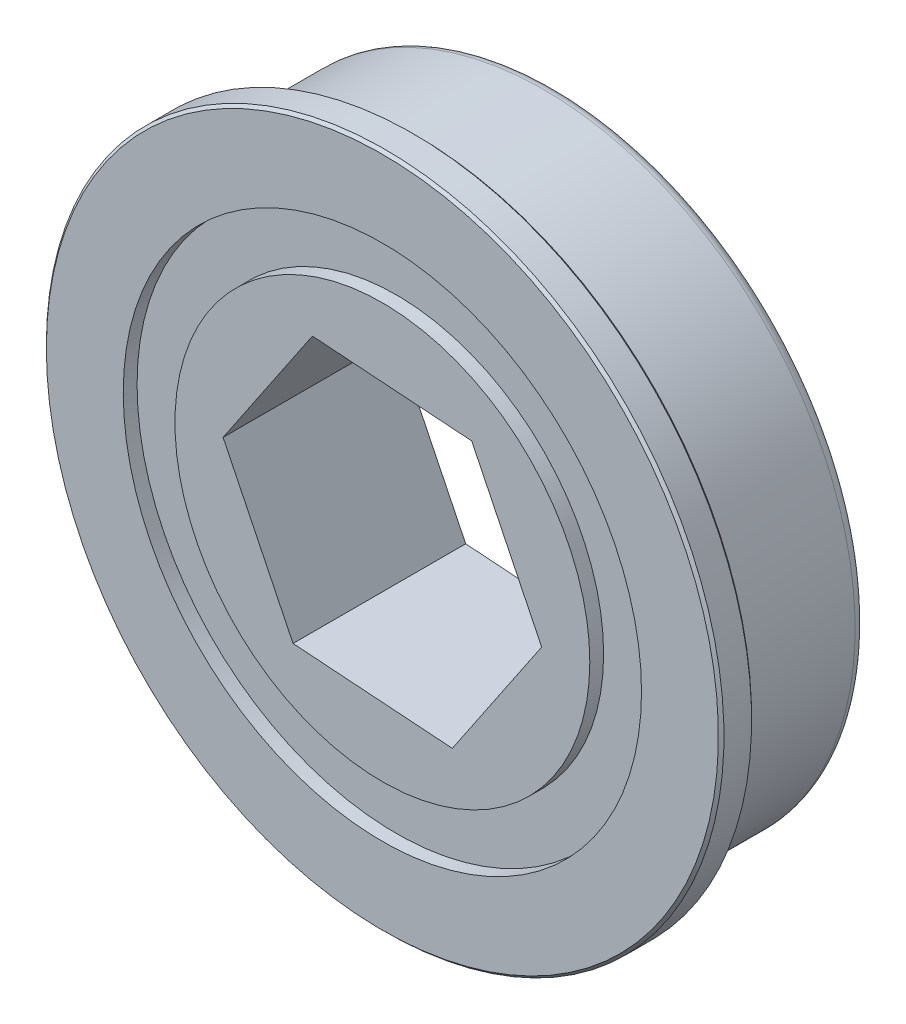
ISO-10303-21;
HEADER;
FILE_DESCRIPTION(('STEP AP214'),'2;1');
FILE_NAME('part.step','',(''),(''),'','','');
FILE_SCHEMA(('AUTOMOTIVE_DESIGN { 1 0 10303 214 1 1 1 1 }'));
ENDSEC;
DATA;
#1=APPLICATION_CONTEXT('core data for automotive mechanical design processes');
#2=APPLICATION_PROTOCOL_DEFINITION('international standard','automotive_design',2000,#1);
#3=PRODUCT_CONTEXT('',#1,'mechanical');
#4=PRODUCT('Part','Part','',(#3));
#5=PRODUCT_RELATED_PRODUCT_CATEGORY('part','',(#4));
#6=PRODUCT_DEFINITION_FORMATION('','',#4);
#7=PRODUCT_DEFINITION_CONTEXT('part definition',#1,'design');
#8=PRODUCT_DEFINITION('design','',#6,#7);
#9=PRODUCT_DEFINITION_SHAPE('','',#8);
#10=(LENGTH_UNIT() NAMED_UNIT(*) SI_UNIT(.MILLI.,.METRE.));
#11=(NAMED_UNIT(*) PLANE_ANGLE_UNIT() SI_UNIT($,.RADIAN.));
#12=(NAMED_UNIT(*) SI_UNIT($,.STERADIAN.) SOLID_ANGLE_UNIT());
#13=UNCERTAINTY_MEASURE_WITH_UNIT(LENGTH_MEASURE(1.E-05),#10,'distance_accuracy_value','');
#14=(GEOMETRIC_REPRESENTATION_CONTEXT(3) GLOBAL_UNCERTAINTY_ASSIGNED_CONTEXT((#13)) GLOBAL_UNIT_ASSIGNED_CONTEXT((#10,
#11,#12)) REPRESENTATION_CONTEXT('',''));
#15=CARTESIAN_POINT('',(0.,0.,0.));
#16=DIRECTION('',(0.,0.,1.));
#17=DIRECTION('',(1.,0.,0.));
#18=AXIS2_PLACEMENT_3D('',#15,#16,#17);
#19=CARTESIAN_POINT('',(0.,0.,-0.000999999999999265));
#20=DIRECTION('',(0.,0.,1.));
#21=DIRECTION('',(1.,0.,0.));
#22=AXIS2_PLACEMENT_3D('',#19,#20,#21);
#23=CYLINDRICAL_SURFACE('',#22,11.8991111578808);
#24=CARTESIAN_POINT('',(0.,0.,0.635));
#25=DIRECTION('',(0.,0.,-1.));
#26=DIRECTION('',(-1.,0.,0.));
#27=AXIS2_PLACEMENT_3D('',#24,#25,#26);
#28=CIRCLE('',#27,11.8991111578808);
#29=CARTESIAN_POINT('',(-11.8991111578808,0.,0.635));
#30=VERTEX_POINT('',#29);
#31=EDGE_CURVE('E126',#30,#30,#28,.T.);
#32=ORIENTED_EDGE('',*,*,#31,.F.);
#33=EDGE_LOOP('',(#32));
#34=FACE_BOUND('',#33,.T.);
#35=CARTESIAN_POINT('',(0.,0.,0.));
#36=DIRECTION('',(0.,0.,-1.));
#37=DIRECTION('',(-1.,0.,0.));
#38=AXIS2_PLACEMENT_3D('',#35,#36,#37);
#39=CIRCLE('',#38,11.8991111578808);
#40=CARTESIAN_POINT('',(-11.8991111578808,0.,0.));
#41=VERTEX_POINT('',#40);
#42=EDGE_CURVE('E129',#41,#41,#39,.F.);
#43=ORIENTED_EDGE('',*,*,#42,.F.);
#44=EDGE_LOOP('',(#43));
#45=FACE_BOUND('',#44,.T.);
#46=ADVANCED_FACE('F34',(#34,#45),#23,.F.);
#47=CARTESIAN_POINT('',(0.,0.,7.80034));
#48=DIRECTION('',(0.,0.,-1.));
#49=DIRECTION('',(-1.,0.,0.));
#50=AXIS2_PLACEMENT_3D('',#47,#48,#49);
#51=CONICAL_SURFACE('',#50,15.5575,0.785398163397442);
#52=CARTESIAN_POINT('',(0.,0.,7.92734));
#53=DIRECTION('',(0.,0.,-1.));
#54=DIRECTION('',(-1.,0.,0.));
#55=AXIS2_PLACEMENT_3D('',#52,#53,#54);
#56=CIRCLE('',#55,15.4305);
#57=CARTESIAN_POINT('',(-15.4305,0.,7.92734));
#58=VERTEX_POINT('',#57);
#59=EDGE_CURVE('E152',#58,#58,#56,.T.);
#60=ORIENTED_EDGE('',*,*,#59,.T.);
#61=EDGE_LOOP('',(#60));
#62=FACE_BOUND('',#61,.T.);
#63=CARTESIAN_POINT('',(0.,0.,7.80034));
#64=DIRECTION('',(0.,0.,-1.));
#65=DIRECTION('',(-1.,0.,0.));
#66=AXIS2_PLACEMENT_3D('',#63,#64,#65);
#67=CIRCLE('',#66,15.5575);
#68=CARTESIAN_POINT('',(-15.5575,0.,7.80034));
#69=VERTEX_POINT('',#68);
#70=EDGE_CURVE('E138',#69,#69,#67,.T.);
#71=ORIENTED_EDGE('',*,*,#70,.F.);
#72=EDGE_LOOP('',(#71));
#73=FACE_BOUND('',#72,.T.);
#74=ADVANCED_FACE('F180',(#62,#73),#51,.T.);
#75=CARTESIAN_POINT('',(15.4305,0.,7.92734));
#76=DIRECTION('',(0.,0.,1.));
#77=DIRECTION('',(1.,0.,0.));
#78=AXIS2_PLACEMENT_3D('',#75,#76,#77);
#79=PLANE('',#78);
#80=CARTESIAN_POINT('',(0.,0.,7.92734));
#81=DIRECTION('',(0.,0.,1.));
#82=DIRECTION('',(1.,0.,0.));
#83=AXIS2_PLACEMENT_3D('',#80,#81,#82);
#84=CIRCLE('',#83,11.8991111578808);
#85=CARTESIAN_POINT('',(11.8991111578808,0.,7.92734));
#86=VERTEX_POINT('',#85);
#87=EDGE_CURVE('E135',#86,#86,#84,.T.);
#88=ORIENTED_EDGE('',*,*,#87,.F.);
#89=EDGE_LOOP('',(#88));
#90=FACE_BOUND('',#89,.T.);
#91=ORIENTED_EDGE('',*,*,#59,.F.);
#92=EDGE_LOOP('',(#91));
#93=FACE_BOUND('',#92,.T.);
#94=ADVANCED_FACE('F185',(#90,#93),#79,.T.);
#95=CARTESIAN_POINT('',(0.,0.,0.));
#96=DIRECTION('',(0.,0.,-1.));
#97=DIRECTION('',(-1.,0.,0.));
#98=AXIS2_PLACEMENT_3D('',#95,#96,#97);
#99=PLANE('',#98);
#100=ORIENTED_EDGE('',*,*,#42,.T.);
#101=EDGE_LOOP('',(#100));
#102=FACE_BOUND('',#101,.T.);
#103=CARTESIAN_POINT('',(0.,0.,0.));
#104=DIRECTION('',(0.,0.,-1.));
#105=DIRECTION('',(-1.,0.,0.));
#106=AXIS2_PLACEMENT_3D('',#103,#104,#105);
#107=CIRCLE('',#106,13.7795);
#108=CARTESIAN_POINT('',(-13.7795,0.,0.));
#109=VERTEX_POINT('',#108);
#110=EDGE_CURVE('E42',#109,#109,#107,.T.);
#111=ORIENTED_EDGE('',*,*,#110,.T.);
#112=EDGE_LOOP('',(#111));
#113=FACE_BOUND('',#112,.T.);
#114=ADVANCED_FACE('F163',(#102,#113),#99,.T.);
#115=CARTESIAN_POINT('',(0.,0.,7.92734));
#116=DIRECTION('',(0.,0.,-1.));
#117=DIRECTION('',(-1.,0.,0.));
#118=AXIS2_PLACEMENT_3D('',#115,#116,#117);
#119=CYLINDRICAL_SURFACE('',#118,14.2875);
#120=CARTESIAN_POINT('',(0.,0.,0.508));
#121=DIRECTION('',(0.,0.,-1.));
#122=DIRECTION('',(-1.,0.,0.));
#123=AXIS2_PLACEMENT_3D('',#120,#121,#122);
#124=CIRCLE('',#123,14.2875);
#125=CARTESIAN_POINT('',(-14.2875,0.,0.508));
#126=VERTEX_POINT('',#125);
#127=EDGE_CURVE('E12',#126,#126,#124,.F.);
#128=ORIENTED_EDGE('',*,*,#127,.T.);
#129=EDGE_LOOP('',(#128));
#130=FACE_BOUND('',#129,.T.);
#131=CARTESIAN_POINT('',(0.,0.,5.89534));
#132=DIRECTION('',(0.,0.,-1.));
#133=DIRECTION('',(-1.,0.,0.));
#134=AXIS2_PLACEMENT_3D('',#131,#132,#133);
#135=CIRCLE('',#134,14.2875);
#136=CARTESIAN_POINT('',(-14.2875,0.,5.89534));
#137=VERTEX_POINT('',#136);
#138=EDGE_CURVE('E149',#137,#137,#135,.T.);
#139=ORIENTED_EDGE('',*,*,#138,.T.);
#140=EDGE_LOOP('',(#139));
#141=FACE_BOUND('',#140,.T.);
#142=ADVANCED_FACE('F208',(#130,#141),#119,.T.);
#143=CARTESIAN_POINT('',(14.2875,0.,5.89534));
#144=DIRECTION('',(0.,0.,1.));
#145=DIRECTION('',(1.,0.,0.));
#146=AXIS2_PLACEMENT_3D('',#143,#144,#145);
#147=PLANE('',#146);
#148=CARTESIAN_POINT('',(0.,0.,5.89534));
#149=DIRECTION('',(0.,0.,-1.));
#150=DIRECTION('',(-1.,0.,0.));
#151=AXIS2_PLACEMENT_3D('',#148,#149,#150);
#152=CIRCLE('',#151,13.97);
#153=CARTESIAN_POINT('',(-13.97,0.,5.89534));
#154=VERTEX_POINT('',#153);
#155=EDGE_CURVE('E146',#154,#154,#152,.T.);
#156=ORIENTED_EDGE('',*,*,#155,.T.);
#157=EDGE_LOOP('',(#156));
#158=FACE_BOUND('',#157,.T.);
#159=ORIENTED_EDGE('',*,*,#138,.F.);
#160=EDGE_LOOP('',(#159));
#161=FACE_BOUND('',#160,.T.);
#162=ADVANCED_FACE('F204',(#158,#161),#147,.T.);
#163=CARTESIAN_POINT('',(0.,0.,7.92734));
#164=DIRECTION('',(0.,0.,-1.));
#165=DIRECTION('',(-1.,0.,0.));
#166=AXIS2_PLACEMENT_3D('',#163,#164,#165);
#167=CYLINDRICAL_SURFACE('',#166,13.97);
#168=CARTESIAN_POINT('',(0.,0.,6.40333999999999));
#169=DIRECTION('',(0.,0.,-1.));
#170=DIRECTION('',(-1.,0.,0.));
#171=AXIS2_PLACEMENT_3D('',#168,#169,#170);
#172=CIRCLE('',#171,13.97);
#173=CARTESIAN_POINT('',(-13.97,0.,6.40333999999999));
#174=VERTEX_POINT('',#173);
#175=EDGE_CURVE('E143',#174,#174,#172,.T.);
#176=ORIENTED_EDGE('',*,*,#175,.T.);
#177=EDGE_LOOP('',(#176));
#178=FACE_BOUND('',#177,.T.);
#179=ORIENTED_EDGE('',*,*,#155,.F.);
#180=EDGE_LOOP('',(#179));
#181=FACE_BOUND('',#180,.T.);
#182=ADVANCED_FACE('F200',(#178,#181),#167,.T.);
#183=CARTESIAN_POINT('',(13.97,0.,6.40334));
#184=DIRECTION('',(0.,0.,-1.));
#185=DIRECTION('',(-1.,0.,0.));
#186=AXIS2_PLACEMENT_3D('',#183,#184,#185);
#187=PLANE('',#186);
#188=CARTESIAN_POINT('',(0.,0.,6.40334));
#189=DIRECTION('',(0.,0.,-1.));
#190=DIRECTION('',(-1.,0.,0.));
#191=AXIS2_PLACEMENT_3D('',#188,#189,#190);
#192=CIRCLE('',#191,15.4305);
#193=CARTESIAN_POINT('',(-15.4305,0.,6.40334));
#194=VERTEX_POINT('',#193);
#195=EDGE_CURVE('E155',#194,#194,#192,.T.);
#196=ORIENTED_EDGE('',*,*,#195,.T.);
#197=EDGE_LOOP('',(#196));
#198=FACE_BOUND('',#197,.T.);
#199=ORIENTED_EDGE('',*,*,#175,.F.);
#200=EDGE_LOOP('',(#199));
#201=FACE_BOUND('',#200,.T.);
#202=ADVANCED_FACE('F196',(#198,#201),#187,.T.);
#203=CARTESIAN_POINT('',(0.,0.,7.92734));
#204=DIRECTION('',(0.,0.,-1.));
#205=DIRECTION('',(-1.,0.,0.));
#206=AXIS2_PLACEMENT_3D('',#203,#204,#205);
#207=CYLINDRICAL_SURFACE('',#206,15.5575);
#208=CARTESIAN_POINT('',(0.,0.,6.53034000000001));
#209=DIRECTION('',(0.,0.,-1.));
#210=DIRECTION('',(-1.,0.,0.));
#211=AXIS2_PLACEMENT_3D('',#208,#209,#210);
#212=CIRCLE('',#211,15.5575);
#213=CARTESIAN_POINT('',(-15.5575,0.,6.53034000000001));
#214=VERTEX_POINT('',#213);
#215=EDGE_CURVE('E158',#214,#214,#212,.F.);
#216=ORIENTED_EDGE('',*,*,#215,.T.);
#217=EDGE_LOOP('',(#216));
#218=FACE_BOUND('',#217,.T.);
#219=ORIENTED_EDGE('',*,*,#70,.T.);
#220=EDGE_LOOP('',(#219));
#221=FACE_BOUND('',#220,.T.);
#222=ADVANCED_FACE('F176',(#218,#221),#207,.T.);
#223=CARTESIAN_POINT('',(0.,0.,6.40334));
#224=DIRECTION('',(0.,0.,1.));
#225=DIRECTION('',(1.,0.,0.));
#226=AXIS2_PLACEMENT_3D('',#223,#224,#225);
#227=CONICAL_SURFACE('',#226,15.4305,0.785398163397407);
#228=ORIENTED_EDGE('',*,*,#215,.F.);
#229=EDGE_LOOP('',(#228));
#230=FACE_BOUND('',#229,.T.);
#231=ORIENTED_EDGE('',*,*,#195,.F.);
#232=EDGE_LOOP('',(#231));
#233=FACE_BOUND('',#232,.T.);
#234=ADVANCED_FACE('F167',(#230,#233),#227,.T.);
#235=CARTESIAN_POINT('',(0.,0.,0.508));
#236=DIRECTION('',(0.,0.,-1.));
#237=DIRECTION('',(-1.,0.,0.));
#238=AXIS2_PLACEMENT_3D('',#235,#236,#237);
#239=TOROIDAL_SURFACE('',#238,13.7795,0.508);
#240=ORIENTED_EDGE('',*,*,#127,.F.);
#241=EDGE_LOOP('',(#240));
#242=FACE_BOUND('',#241,.T.);
#243=ORIENTED_EDGE('',*,*,#110,.F.);
#244=EDGE_LOOP('',(#243));
#245=FACE_BOUND('',#244,.T.);
#246=ADVANCED_FACE('F36',(#242,#245),#239,.T.);
#247=CARTESIAN_POINT('',(0.,0.,7.29234));
#248=DIRECTION('',(0.,0.,1.));
#249=DIRECTION('',(1.,0.,0.));
#250=AXIS2_PLACEMENT_3D('',#247,#248,#249);
#251=CIRCLE('',#250,11.8991111578808);
#252=CARTESIAN_POINT('',(11.8991111578808,0.,7.29234));
#253=VERTEX_POINT('',#252);
#254=EDGE_CURVE('E125',#253,#253,#251,.F.);
#255=ORIENTED_EDGE('',*,*,#254,.T.);
#256=EDGE_LOOP('',(#255));
#257=FACE_BOUND('',#256,.T.);
#258=ORIENTED_EDGE('',*,*,#87,.T.);
#259=EDGE_LOOP('',(#258));
#260=FACE_BOUND('',#259,.T.);
#261=ADVANCED_FACE('F166',(#257,#260),#23,.F.);
#262=CARTESIAN_POINT('',(0.,0.,0.635));
#263=DIRECTION('',(0.,0.,-1.));
#264=DIRECTION('',(-1.,0.,0.));
#265=AXIS2_PLACEMENT_3D('',#262,#263,#264);
#266=PLANE('',#265);
#267=CARTESIAN_POINT('',(0.,0.,0.635));
#268=DIRECTION('',(0.,0.,-1.));
#269=DIRECTION('',(-1.,0.,0.));
#270=AXIS2_PLACEMENT_3D('',#267,#268,#269);
#271=CIRCLE('',#270,9.525);
#272=CARTESIAN_POINT('',(-9.525,0.,0.635));
#273=VERTEX_POINT('',#272);
#274=EDGE_CURVE('E130',#273,#273,#271,.T.);
#275=ORIENTED_EDGE('',*,*,#274,.F.);
#276=EDGE_LOOP('',(#275));
#277=FACE_BOUND('',#276,.T.);
#278=ORIENTED_EDGE('',*,*,#31,.T.);
#279=EDGE_LOOP('',(#278));
#280=FACE_BOUND('',#279,.T.);
#281=ADVANCED_FACE('F173',(#277,#280),#266,.T.);
#282=CARTESIAN_POINT('',(15.4305,0.,7.29234));
#283=DIRECTION('',(0.,0.,1.));
#284=DIRECTION('',(1.,0.,0.));
#285=AXIS2_PLACEMENT_3D('',#282,#283,#284);
#286=PLANE('',#285);
#287=ORIENTED_EDGE('',*,*,#254,.F.);
#288=EDGE_LOOP('',(#287));
#289=FACE_BOUND('',#288,.T.);
#290=CARTESIAN_POINT('',(0.,0.,7.29234));
#291=DIRECTION('',(0.,0.,1.));
#292=DIRECTION('',(1.,0.,0.));
#293=AXIS2_PLACEMENT_3D('',#290,#291,#292);
#294=CIRCLE('',#293,9.525);
#295=CARTESIAN_POINT('',(9.525,0.,7.29234));
#296=VERTEX_POINT('',#295);
#297=EDGE_CURVE('E122',#296,#296,#294,.T.);
#298=ORIENTED_EDGE('',*,*,#297,.F.);
#299=EDGE_LOOP('',(#298));
#300=FACE_BOUND('',#299,.T.);
#301=ADVANCED_FACE('F192',(#289,#300),#286,.T.);
#302=CARTESIAN_POINT('',(0.,0.,34.8681083632075));
#303=DIRECTION('',(0.,0.,-1.));
#304=DIRECTION('',(-1.,0.,0.));
#305=AXIS2_PLACEMENT_3D('',#302,#303,#304);
#306=CYLINDRICAL_SURFACE('',#305,9.525);
#307=ORIENTED_EDGE('',*,*,#274,.T.);
#308=EDGE_LOOP('',(#307));
#309=FACE_BOUND('',#308,.T.);
#310=CARTESIAN_POINT('',(0.,0.,0.));
#311=DIRECTION('',(0.,0.,-1.));
#312=DIRECTION('',(-1.,0.,0.));
#313=AXIS2_PLACEMENT_3D('',#310,#311,#312);
#314=CIRCLE('',#313,9.525);
#315=CARTESIAN_POINT('',(-9.525,0.,0.));
#316=VERTEX_POINT('',#315);
#317=EDGE_CURVE('E398',#316,#316,#314,.T.);
#318=ORIENTED_EDGE('',*,*,#317,.F.);
#319=EDGE_LOOP('',(#318));
#320=FACE_BOUND('',#319,.T.);
#321=ADVANCED_FACE('F278',(#309,#320),#306,.T.);
#322=ORIENTED_EDGE('',*,*,#297,.T.);
#323=EDGE_LOOP('',(#322));
#324=FACE_BOUND('',#323,.T.);
#325=CARTESIAN_POINT('',(0.,0.,7.92734));
#326=DIRECTION('',(0.,0.,1.));
#327=DIRECTION('',(1.,0.,0.));
#328=AXIS2_PLACEMENT_3D('',#325,#326,#327);
#329=CIRCLE('',#328,9.525);
#330=CARTESIAN_POINT('',(9.525,0.,7.92734));
#331=VERTEX_POINT('',#330);
#332=EDGE_CURVE('E114',#331,#331,#329,.F.);
#333=ORIENTED_EDGE('',*,*,#332,.T.);
#334=EDGE_LOOP('',(#333));
#335=FACE_BOUND('',#334,.T.);
#336=ADVANCED_FACE('F284',(#324,#335),#306,.T.);
#337=CARTESIAN_POINT('',(7.31433054001112,-0.513714010705348,34.8681083632075));
#338=DIRECTION('',(0.828866647753209,-0.559446226408184,0.));
#339=DIRECTION('',(0.559446226408184,0.828866647753209,0.));
#340=AXIS2_PLACEMENT_3D('',#337,#338,#339);
#341=PLANE('',#340);
#342=DIRECTION('',(-0.559446226408184,-0.828866647753209,0.));
#343=VECTOR('',#342,1.);
#344=CARTESIAN_POINT('',(7.31433054001112,-0.513714010705348,7.92734));
#345=LINE('',#344,#343);
#346=CARTESIAN_POINT('',(7.31433054001112,-0.513714010705348,7.92734));
#347=VERTEX_POINT('',#346);
#348=CARTESIAN_POINT('',(3.21227588645474,-6.59125306467865,7.92734));
#349=VERTEX_POINT('',#348);
#350=EDGE_CURVE('E107',#347,#349,#345,.T.);
#351=ORIENTED_EDGE('',*,*,#350,.F.);
#352=DIRECTION('',(0.,0.,-1.));
#353=VECTOR('',#352,1.);
#354=CARTESIAN_POINT('',(7.31433054001112,-0.513714010705348,34.8681083632075));
#355=LINE('',#354,#353);
#356=CARTESIAN_POINT('',(7.31433054001112,-0.513714010705348,0.));
#357=VERTEX_POINT('',#356);
#358=EDGE_CURVE('E111',#347,#357,#355,.T.);
#359=ORIENTED_EDGE('',*,*,#358,.T.);
#360=DIRECTION('',(-0.559446226408184,-0.828866647753209,0.));
#361=VECTOR('',#360,1.);
#362=CARTESIAN_POINT('',(7.31433054001112,-0.513714010705348,0.));
#363=LINE('',#362,#361);
#364=CARTESIAN_POINT('',(3.21227588645474,-6.59125306467865,0.));
#365=VERTEX_POINT('',#364);
#366=EDGE_CURVE('E113',#357,#365,#363,.T.);
#367=ORIENTED_EDGE('',*,*,#366,.T.);
#368=DIRECTION('',(0.,0.,-1.));
#369=VECTOR('',#368,1.);
#370=CARTESIAN_POINT('',(3.21227588645474,-6.59125306467865,34.8681083632075));
#371=LINE('',#370,#369);
#372=EDGE_CURVE('E55',#349,#365,#371,.T.);
#373=ORIENTED_EDGE('',*,*,#372,.F.);
#374=EDGE_LOOP('',(#351,#359,#367,#373));
#375=FACE_BOUND('',#374,.T.);
#376=ADVANCED_FACE('F294',(#375),#341,.F.);
#377=CARTESIAN_POINT('',(4.10205465355639,6.0775390539733,34.8681083632075));
#378=DIRECTION('',(0.898927967997433,0.438096460099835,0.));
#379=DIRECTION('',(-0.438096460099835,0.898927967997433,0.));
#380=AXIS2_PLACEMENT_3D('',#377,#378,#379);
#381=PLANE('',#380);
#382=DIRECTION('',(0.438096460099835,-0.898927967997433,0.));
#383=VECTOR('',#382,1.);
#384=CARTESIAN_POINT('',(4.10205465355639,6.0775390539733,7.92734));
#385=LINE('',#384,#383);
#386=CARTESIAN_POINT('',(4.10205465355639,6.0775390539733,7.92734));
#387=VERTEX_POINT('',#386);
#388=EDGE_CURVE('E397',#387,#347,#385,.T.);
#389=ORIENTED_EDGE('',*,*,#388,.F.);
#390=DIRECTION('',(0.,0.,-1.));
#391=VECTOR('',#390,1.);
#392=CARTESIAN_POINT('',(4.10205465355639,6.0775390539733,34.8681083632075));
#393=LINE('',#392,#391);
#394=CARTESIAN_POINT('',(4.10205465355639,6.0775390539733,0.));
#395=VERTEX_POINT('',#394);
#396=EDGE_CURVE('E115',#387,#395,#393,.T.);
#397=ORIENTED_EDGE('',*,*,#396,.T.);
#398=DIRECTION('',(0.438096460099835,-0.898927967997433,0.));
#399=VECTOR('',#398,1.);
#400=CARTESIAN_POINT('',(4.10205465355639,6.0775390539733,0.));
#401=LINE('',#400,#399);
#402=EDGE_CURVE('E117',#395,#357,#401,.T.);
#403=ORIENTED_EDGE('',*,*,#402,.T.);
#404=ORIENTED_EDGE('',*,*,#358,.F.);
#405=EDGE_LOOP('',(#389,#397,#403,#404));
#406=FACE_BOUND('',#405,.T.);
#407=ADVANCED_FACE('F302',(#406),#381,.F.);
#408=CARTESIAN_POINT('',(-3.21227588645473,6.59125306467865,34.8681083632075));
#409=DIRECTION('',(0.0700613202442238,0.997542686508019,0.));
#410=DIRECTION('',(-0.997542686508019,0.0700613202442238,0.));
#411=AXIS2_PLACEMENT_3D('',#408,#409,#410);
#412=PLANE('',#411);
#413=DIRECTION('',(0.997542686508019,-0.0700613202442238,0.));
#414=VECTOR('',#413,1.);
#415=CARTESIAN_POINT('',(-3.21227588645473,6.59125306467865,7.92734));
#416=LINE('',#415,#414);
#417=CARTESIAN_POINT('',(-3.21227588645473,6.59125306467865,7.92734));
#418=VERTEX_POINT('',#417);
#419=EDGE_CURVE('E90',#418,#387,#416,.T.);
#420=ORIENTED_EDGE('',*,*,#419,.F.);
#421=DIRECTION('',(0.,0.,-1.));
#422=VECTOR('',#421,1.);
#423=CARTESIAN_POINT('',(-3.21227588645473,6.59125306467865,34.8681083632075));
#424=LINE('',#423,#422);
#425=CARTESIAN_POINT('',(-3.21227588645473,6.59125306467865,0.));
#426=VERTEX_POINT('',#425);
#427=EDGE_CURVE('E86',#418,#426,#424,.T.);
#428=ORIENTED_EDGE('',*,*,#427,.T.);
#429=DIRECTION('',(0.997542686508019,-0.0700613202442238,0.));
#430=VECTOR('',#429,1.);
#431=CARTESIAN_POINT('',(-3.21227588645473,6.59125306467865,0.));
#432=LINE('',#431,#430);
#433=EDGE_CURVE('E100',#426,#395,#432,.T.);
#434=ORIENTED_EDGE('',*,*,#433,.T.);
#435=ORIENTED_EDGE('',*,*,#396,.F.);
#436=EDGE_LOOP('',(#420,#428,#434,#435));
#437=FACE_BOUND('',#436,.T.);
#438=ADVANCED_FACE('F311',(#437),#412,.F.);
#439=CARTESIAN_POINT('',(-7.31433054001111,0.513714010705348,34.8681083632075));
#440=DIRECTION('',(-0.828866647753209,0.559446226408184,0.));
#441=DIRECTION('',(-0.559446226408184,-0.828866647753209,0.));
#442=AXIS2_PLACEMENT_3D('',#439,#440,#441);
#443=PLANE('',#442);
#444=DIRECTION('',(0.559446226408184,0.828866647753209,0.));
#445=VECTOR('',#444,1.);
#446=CARTESIAN_POINT('',(-7.31433054001111,0.513714010705348,7.92734));
#447=LINE('',#446,#445);
#448=CARTESIAN_POINT('',(-7.31433054001111,0.513714010705348,7.92734));
#449=VERTEX_POINT('',#448);
#450=EDGE_CURVE('E84',#449,#418,#447,.T.);
#451=ORIENTED_EDGE('',*,*,#450,.F.);
#452=DIRECTION('',(0.,0.,-1.));
#453=VECTOR('',#452,1.);
#454=CARTESIAN_POINT('',(-7.31433054001111,0.513714010705348,34.8681083632075));
#455=LINE('',#454,#453);
#456=CARTESIAN_POINT('',(-7.31433054001111,0.513714010705348,0.));
#457=VERTEX_POINT('',#456);
#458=EDGE_CURVE('E80',#449,#457,#455,.T.);
#459=ORIENTED_EDGE('',*,*,#458,.T.);
#460=DIRECTION('',(0.559446226408184,0.828866647753209,0.));
#461=VECTOR('',#460,1.);
#462=CARTESIAN_POINT('',(-7.31433054001111,0.513714010705348,0.));
#463=LINE('',#462,#461);
#464=EDGE_CURVE('E99',#457,#426,#463,.T.);
#465=ORIENTED_EDGE('',*,*,#464,.T.);
#466=ORIENTED_EDGE('',*,*,#427,.F.);
#467=EDGE_LOOP('',(#451,#459,#465,#466));
#468=FACE_BOUND('',#467,.T.);
#469=ADVANCED_FACE('F85',(#468),#443,.F.);
#470=CARTESIAN_POINT('',(-4.10205465355638,-6.0775390539733,34.8681083632075));
#471=DIRECTION('',(-0.898927967997433,-0.438096460099835,0.));
#472=DIRECTION('',(0.438096460099835,-0.898927967997433,0.));
#473=AXIS2_PLACEMENT_3D('',#470,#471,#472);
#474=PLANE('',#473);
#475=DIRECTION('',(-0.438096460099835,0.898927967997433,0.));
#476=VECTOR('',#475,1.);
#477=CARTESIAN_POINT('',(-4.10205465355638,-6.0775390539733,7.92734));
#478=LINE('',#477,#476);
#479=CARTESIAN_POINT('',(-4.10205465355638,-6.0775390539733,7.92734));
#480=VERTEX_POINT('',#479);
#481=EDGE_CURVE('E91',#480,#449,#478,.T.);
#482=ORIENTED_EDGE('',*,*,#481,.F.);
#483=DIRECTION('',(0.,0.,-1.));
#484=VECTOR('',#483,1.);
#485=CARTESIAN_POINT('',(-4.10205465355638,-6.0775390539733,34.8681083632075));
#486=LINE('',#485,#484);
#487=CARTESIAN_POINT('',(-4.10205465355638,-6.0775390539733,0.));
#488=VERTEX_POINT('',#487);
#489=EDGE_CURVE('E49',#480,#488,#486,.T.);
#490=ORIENTED_EDGE('',*,*,#489,.T.);
#491=DIRECTION('',(-0.438096460099835,0.898927967997433,0.));
#492=VECTOR('',#491,1.);
#493=CARTESIAN_POINT('',(-4.10205465355638,-6.0775390539733,0.));
#494=LINE('',#493,#492);
#495=EDGE_CURVE('E97',#488,#457,#494,.T.);
#496=ORIENTED_EDGE('',*,*,#495,.T.);
#497=ORIENTED_EDGE('',*,*,#458,.F.);
#498=EDGE_LOOP('',(#482,#490,#496,#497));
#499=FACE_BOUND('',#498,.T.);
#500=ADVANCED_FACE('F94',(#499),#474,.F.);
#501=CARTESIAN_POINT('',(3.21227588645474,-6.59125306467865,34.8681083632075));
#502=DIRECTION('',(-0.0700613202442235,-0.997542686508019,0.));
#503=DIRECTION('',(0.997542686508019,-0.0700613202442235,0.));
#504=AXIS2_PLACEMENT_3D('',#501,#502,#503);
#505=PLANE('',#504);
#506=DIRECTION('',(-0.997542686508019,0.0700613202442235,0.));
#507=VECTOR('',#506,1.);
#508=CARTESIAN_POINT('',(3.21227588645474,-6.59125306467865,7.92734));
#509=LINE('',#508,#507);
#510=EDGE_CURVE('E105',#349,#480,#509,.T.);
#511=ORIENTED_EDGE('',*,*,#510,.F.);
#512=ORIENTED_EDGE('',*,*,#372,.T.);
#513=DIRECTION('',(-0.997542686508019,0.0700613202442235,0.));
#514=VECTOR('',#513,1.);
#515=CARTESIAN_POINT('',(3.21227588645474,-6.59125306467865,0.));
#516=LINE('',#515,#514);
#517=EDGE_CURVE('E121',#365,#488,#516,.T.);
#518=ORIENTED_EDGE('',*,*,#517,.T.);
#519=ORIENTED_EDGE('',*,*,#489,.F.);
#520=EDGE_LOOP('',(#511,#512,#518,#519));
#521=FACE_BOUND('',#520,.T.);
#522=ADVANCED_FACE('F335',(#521),#505,.F.);
#523=CARTESIAN_POINT('',(0.,0.,0.));
#524=DIRECTION('',(0.,0.,-1.));
#525=DIRECTION('',(-1.,0.,0.));
#526=AXIS2_PLACEMENT_3D('',#523,#524,#525);
#527=PLANE('',#526);
#528=ORIENTED_EDGE('',*,*,#366,.F.);
#529=ORIENTED_EDGE('',*,*,#402,.F.);
#530=ORIENTED_EDGE('',*,*,#433,.F.);
#531=ORIENTED_EDGE('',*,*,#464,.F.);
#532=ORIENTED_EDGE('',*,*,#495,.F.);
#533=ORIENTED_EDGE('',*,*,#517,.F.);
#534=EDGE_LOOP('',(#528,#529,#530,#531,#532,#533));
#535=FACE_BOUND('',#534,.T.);
#536=ORIENTED_EDGE('',*,*,#317,.T.);
#537=EDGE_LOOP('',(#536));
#538=FACE_BOUND('',#537,.T.);
#539=ADVANCED_FACE('F343',(#535,#538),#527,.T.);
#540=CARTESIAN_POINT('',(15.4305,0.,7.92734));
#541=DIRECTION('',(0.,0.,1.));
#542=DIRECTION('',(1.,0.,0.));
#543=AXIS2_PLACEMENT_3D('',#540,#541,#542);
#544=PLANE('',#543);
#545=ORIENTED_EDGE('',*,*,#332,.F.);
#546=EDGE_LOOP('',(#545));
#547=FACE_BOUND('',#546,.T.);
#548=ORIENTED_EDGE('',*,*,#388,.T.);
#549=ORIENTED_EDGE('',*,*,#350,.T.);
#550=ORIENTED_EDGE('',*,*,#510,.T.);
#551=ORIENTED_EDGE('',*,*,#481,.T.);
#552=ORIENTED_EDGE('',*,*,#450,.T.);
#553=ORIENTED_EDGE('',*,*,#419,.T.);
#554=EDGE_LOOP('',(#548,#549,#550,#551,#552,#553));
#555=FACE_BOUND('',#554,.T.);
#556=ADVANCED_FACE('F103',(#547,#555),#544,.T.);
#557=CLOSED_SHELL('',(#46,#74,#94,#114,#142,#162,#182,#202,#222,#234,#246,#261,#281,#301,#321,
#336,#376,#407,#438,#469,#500,#522,#539,#556));
#558=MANIFOLD_SOLID_BREP('B2',#557);
#559=ADVANCED_BREP_SHAPE_REPRESENTATION('',(#18,#558),#14);
#560=SHAPE_DEFINITION_REPRESENTATION(#9,#559);
ENDSEC;
END-ISO-10303-21;
